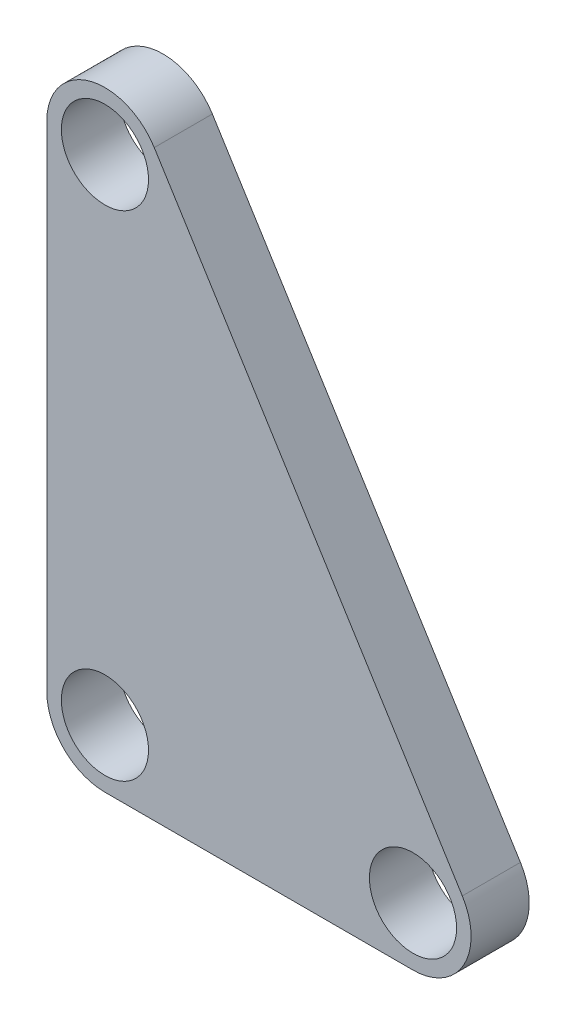
ISO-10303-21;
HEADER;
FILE_DESCRIPTION(('STEP AP214'),'2;1');
FILE_NAME('part.step','',(''),(''),'','','');
FILE_SCHEMA(('AUTOMOTIVE_DESIGN { 1 0 10303 214 1 1 1 1 }'));
ENDSEC;
DATA;
#1=APPLICATION_CONTEXT('core data for automotive mechanical design processes');
#2=APPLICATION_PROTOCOL_DEFINITION('international standard','automotive_design',2000,#1);
#3=PRODUCT_CONTEXT('',#1,'mechanical');
#4=PRODUCT('Part','Part','',(#3));
#5=PRODUCT_RELATED_PRODUCT_CATEGORY('part','',(#4));
#6=PRODUCT_DEFINITION_FORMATION('','',#4);
#7=PRODUCT_DEFINITION_CONTEXT('part definition',#1,'design');
#8=PRODUCT_DEFINITION('design','',#6,#7);
#9=PRODUCT_DEFINITION_SHAPE('','',#8);
#10=(LENGTH_UNIT() NAMED_UNIT(*) SI_UNIT(.MILLI.,.METRE.));
#11=(NAMED_UNIT(*) PLANE_ANGLE_UNIT() SI_UNIT($,.RADIAN.));
#12=(NAMED_UNIT(*) SI_UNIT($,.STERADIAN.) SOLID_ANGLE_UNIT());
#13=UNCERTAINTY_MEASURE_WITH_UNIT(LENGTH_MEASURE(1.E-05),#10,'distance_accuracy_value','');
#14=(GEOMETRIC_REPRESENTATION_CONTEXT(3) GLOBAL_UNCERTAINTY_ASSIGNED_CONTEXT((#13)) GLOBAL_UNIT_ASSIGNED_CONTEXT((#10,
#11,#12)) REPRESENTATION_CONTEXT('',''));
#15=CARTESIAN_POINT('',(0.,0.,0.));
#16=DIRECTION('',(0.,0.,1.));
#17=DIRECTION('',(1.,0.,0.));
#18=AXIS2_PLACEMENT_3D('',#15,#16,#17);
#19=CARTESIAN_POINT('',(1.,9.5,1.));
#20=DIRECTION('',(0.,0.,1.));
#21=DIRECTION('',(1.,0.,0.));
#22=AXIS2_PLACEMENT_3D('',#19,#20,#21);
#23=PLANE('',#22);
#24=CARTESIAN_POINT('',(1.,9.5,1.));
#25=DIRECTION('',(0.,0.,1.));
#26=DIRECTION('',(1.,0.,0.));
#27=AXIS2_PLACEMENT_3D('',#24,#25,#26);
#28=CIRCLE('',#27,0.750000000000001);
#29=CARTESIAN_POINT('',(1.75,9.5,1.));
#30=VERTEX_POINT('',#29);
#31=EDGE_CURVE('E185',#30,#30,#28,.T.);
#32=ORIENTED_EDGE('',*,*,#31,.F.);
#33=EDGE_LOOP('',(#32));
#34=FACE_BOUND('',#33,.T.);
#35=CARTESIAN_POINT('',(1.,9.5,1.));
#36=DIRECTION('',(0.,0.,1.));
#37=DIRECTION('',(1.,0.,0.));
#38=AXIS2_PLACEMENT_3D('',#35,#36,#37);
#39=CIRCLE('',#38,1.);
#40=CARTESIAN_POINT('',(1.84855867434084,10.0291012910596,1.));
#41=VERTEX_POINT('',#40);
#42=CARTESIAN_POINT('',(0.,9.5,1.));
#43=VERTEX_POINT('',#42);
#44=EDGE_CURVE('E130',#41,#43,#39,.T.);
#45=ORIENTED_EDGE('',*,*,#44,.T.);
#46=DIRECTION('',(0.,-1.,0.));
#47=VECTOR('',#46,1.);
#48=CARTESIAN_POINT('',(0.,9.5,1.));
#49=LINE('',#48,#47);
#50=CARTESIAN_POINT('',(0.,1.,1.));
#51=VERTEX_POINT('',#50);
#52=EDGE_CURVE('E88',#43,#51,#49,.T.);
#53=ORIENTED_EDGE('',*,*,#52,.T.);
#54=CARTESIAN_POINT('',(1.,1.,1.));
#55=DIRECTION('',(0.,0.,1.));
#56=DIRECTION('',(1.,0.,0.));
#57=AXIS2_PLACEMENT_3D('',#54,#55,#56);
#58=CIRCLE('',#57,1.);
#59=CARTESIAN_POINT('',(1.,0.,1.));
#60=VERTEX_POINT('',#59);
#61=EDGE_CURVE('E101',#51,#60,#58,.T.);
#62=ORIENTED_EDGE('',*,*,#61,.T.);
#63=DIRECTION('',(1.,0.,0.));
#64=VECTOR('',#63,1.);
#65=CARTESIAN_POINT('',(1.,0.,1.));
#66=LINE('',#65,#64);
#67=CARTESIAN_POINT('',(6.3,0.,1.));
#68=VERTEX_POINT('',#67);
#69=EDGE_CURVE('E95',#60,#68,#66,.T.);
#70=ORIENTED_EDGE('',*,*,#69,.T.);
#71=CARTESIAN_POINT('',(6.3,1.,1.));
#72=DIRECTION('',(0.,0.,1.));
#73=DIRECTION('',(1.,0.,0.));
#74=AXIS2_PLACEMENT_3D('',#71,#72,#73);
#75=CIRCLE('',#74,1.);
#76=CARTESIAN_POINT('',(7.14855867434084,1.52910129105958,1.));
#77=VERTEX_POINT('',#76);
#78=EDGE_CURVE('E99',#68,#77,#75,.T.);
#79=ORIENTED_EDGE('',*,*,#78,.T.);
#80=DIRECTION('',(-0.529101291059582,0.84855867434084,0.));
#81=VECTOR('',#80,1.);
#82=CARTESIAN_POINT('',(7.14855867434084,1.52910129105958,1.));
#83=LINE('',#82,#81);
#84=EDGE_CURVE('E51',#77,#41,#83,.T.);
#85=ORIENTED_EDGE('',*,*,#84,.T.);
#86=EDGE_LOOP('',(#45,#53,#62,#70,#79,#85));
#87=FACE_BOUND('',#86,.T.);
#88=CARTESIAN_POINT('',(1.,1.,1.));
#89=DIRECTION('',(0.,0.,1.));
#90=DIRECTION('',(1.,0.,0.));
#91=AXIS2_PLACEMENT_3D('',#88,#89,#90);
#92=CIRCLE('',#91,0.750000000000001);
#93=CARTESIAN_POINT('',(1.75,1.,1.));
#94=VERTEX_POINT('',#93);
#95=EDGE_CURVE('E123',#94,#94,#92,.T.);
#96=ORIENTED_EDGE('',*,*,#95,.F.);
#97=EDGE_LOOP('',(#96));
#98=FACE_BOUND('',#97,.T.);
#99=CARTESIAN_POINT('',(6.3,1.,1.));
#100=DIRECTION('',(0.,0.,1.));
#101=DIRECTION('',(1.,0.,0.));
#102=AXIS2_PLACEMENT_3D('',#99,#100,#101);
#103=CIRCLE('',#102,0.750000000000002);
#104=CARTESIAN_POINT('',(7.05,1.,1.));
#105=VERTEX_POINT('',#104);
#106=EDGE_CURVE('E176',#105,#105,#103,.T.);
#107=ORIENTED_EDGE('',*,*,#106,.F.);
#108=EDGE_LOOP('',(#107));
#109=FACE_BOUND('',#108,.T.);
#110=ADVANCED_FACE('F34',(#34,#87,#98,#109),#23,.T.);
#111=CARTESIAN_POINT('',(1.,9.5,0.));
#112=DIRECTION('',(0.,0.,1.));
#113=DIRECTION('',(1.,0.,0.));
#114=AXIS2_PLACEMENT_3D('',#111,#112,#113);
#115=PLANE('',#114);
#116=CARTESIAN_POINT('',(1.,9.5,0.));
#117=DIRECTION('',(0.,0.,1.));
#118=DIRECTION('',(1.,0.,0.));
#119=AXIS2_PLACEMENT_3D('',#116,#117,#118);
#120=CIRCLE('',#119,1.);
#121=CARTESIAN_POINT('',(1.84855867434084,10.0291012910596,0.));
#122=VERTEX_POINT('',#121);
#123=CARTESIAN_POINT('',(0.,9.5,0.));
#124=VERTEX_POINT('',#123);
#125=EDGE_CURVE('E119',#122,#124,#120,.T.);
#126=ORIENTED_EDGE('',*,*,#125,.F.);
#127=DIRECTION('',(-0.529101291059582,0.84855867434084,0.));
#128=VECTOR('',#127,1.);
#129=CARTESIAN_POINT('',(7.14855867434084,1.52910129105958,0.));
#130=LINE('',#129,#128);
#131=CARTESIAN_POINT('',(7.14855867434084,1.52910129105958,0.));
#132=VERTEX_POINT('',#131);
#133=EDGE_CURVE('E80',#132,#122,#130,.T.);
#134=ORIENTED_EDGE('',*,*,#133,.F.);
#135=CARTESIAN_POINT('',(6.3,1.,0.));
#136=DIRECTION('',(0.,0.,1.));
#137=DIRECTION('',(1.,0.,0.));
#138=AXIS2_PLACEMENT_3D('',#135,#136,#137);
#139=CIRCLE('',#138,1.);
#140=CARTESIAN_POINT('',(6.3,0.,0.));
#141=VERTEX_POINT('',#140);
#142=EDGE_CURVE('E74',#141,#132,#139,.T.);
#143=ORIENTED_EDGE('',*,*,#142,.F.);
#144=DIRECTION('',(1.,0.,0.));
#145=VECTOR('',#144,1.);
#146=CARTESIAN_POINT('',(1.,0.,0.));
#147=LINE('',#146,#145);
#148=CARTESIAN_POINT('',(1.,0.,0.));
#149=VERTEX_POINT('',#148);
#150=EDGE_CURVE('E109',#149,#141,#147,.T.);
#151=ORIENTED_EDGE('',*,*,#150,.F.);
#152=CARTESIAN_POINT('',(1.,1.,0.));
#153=DIRECTION('',(0.,0.,1.));
#154=DIRECTION('',(1.,0.,0.));
#155=AXIS2_PLACEMENT_3D('',#152,#153,#154);
#156=CIRCLE('',#155,1.);
#157=CARTESIAN_POINT('',(0.,1.,0.));
#158=VERTEX_POINT('',#157);
#159=EDGE_CURVE('E125',#158,#149,#156,.T.);
#160=ORIENTED_EDGE('',*,*,#159,.F.);
#161=DIRECTION('',(0.,-1.,0.));
#162=VECTOR('',#161,1.);
#163=CARTESIAN_POINT('',(0.,9.5,0.));
#164=LINE('',#163,#162);
#165=EDGE_CURVE('E122',#124,#158,#164,.T.);
#166=ORIENTED_EDGE('',*,*,#165,.F.);
#167=EDGE_LOOP('',(#126,#134,#143,#151,#160,#166));
#168=FACE_BOUND('',#167,.T.);
#169=CARTESIAN_POINT('',(1.,1.,0.));
#170=DIRECTION('',(0.,0.,1.));
#171=DIRECTION('',(1.,0.,0.));
#172=AXIS2_PLACEMENT_3D('',#169,#170,#171);
#173=CIRCLE('',#172,0.750000000000001);
#174=CARTESIAN_POINT('',(1.75,1.,0.));
#175=VERTEX_POINT('',#174);
#176=EDGE_CURVE('E188',#175,#175,#173,.T.);
#177=ORIENTED_EDGE('',*,*,#176,.T.);
#178=EDGE_LOOP('',(#177));
#179=FACE_BOUND('',#178,.T.);
#180=CARTESIAN_POINT('',(1.,9.5,0.));
#181=DIRECTION('',(0.,0.,1.));
#182=DIRECTION('',(1.,0.,0.));
#183=AXIS2_PLACEMENT_3D('',#180,#181,#182);
#184=CIRCLE('',#183,0.750000000000001);
#185=CARTESIAN_POINT('',(1.75,9.5,0.));
#186=VERTEX_POINT('',#185);
#187=EDGE_CURVE('E182',#186,#186,#184,.T.);
#188=ORIENTED_EDGE('',*,*,#187,.T.);
#189=EDGE_LOOP('',(#188));
#190=FACE_BOUND('',#189,.T.);
#191=CARTESIAN_POINT('',(6.3,1.,0.));
#192=DIRECTION('',(0.,0.,1.));
#193=DIRECTION('',(1.,0.,0.));
#194=AXIS2_PLACEMENT_3D('',#191,#192,#193);
#195=CIRCLE('',#194,0.750000000000002);
#196=CARTESIAN_POINT('',(7.05,1.,0.));
#197=VERTEX_POINT('',#196);
#198=EDGE_CURVE('E179',#197,#197,#195,.T.);
#199=ORIENTED_EDGE('',*,*,#198,.T.);
#200=EDGE_LOOP('',(#199));
#201=FACE_BOUND('',#200,.T.);
#202=ADVANCED_FACE('F139',(#168,#179,#190,#201),#115,.F.);
#203=CARTESIAN_POINT('',(1.,9.5,1.));
#204=DIRECTION('',(0.,0.,-1.));
#205=DIRECTION('',(-1.,0.,0.));
#206=AXIS2_PLACEMENT_3D('',#203,#204,#205);
#207=CYLINDRICAL_SURFACE('',#206,1.);
#208=ORIENTED_EDGE('',*,*,#125,.T.);
#209=DIRECTION('',(0.,0.,-1.));
#210=VECTOR('',#209,1.);
#211=CARTESIAN_POINT('',(0.,9.5,1.));
#212=LINE('',#211,#210);
#213=EDGE_CURVE('E11',#43,#124,#212,.T.);
#214=ORIENTED_EDGE('',*,*,#213,.F.);
#215=ORIENTED_EDGE('',*,*,#44,.F.);
#216=DIRECTION('',(0.,0.,-1.));
#217=VECTOR('',#216,1.);
#218=CARTESIAN_POINT('',(1.84855867434084,10.0291012910596,1.));
#219=LINE('',#218,#217);
#220=EDGE_CURVE('E115',#41,#122,#219,.T.);
#221=ORIENTED_EDGE('',*,*,#220,.T.);
#222=EDGE_LOOP('',(#208,#214,#215,#221));
#223=FACE_BOUND('',#222,.T.);
#224=ADVANCED_FACE('F36',(#223),#207,.T.);
#225=CARTESIAN_POINT('',(0.,9.5,1.));
#226=DIRECTION('',(1.,0.,0.));
#227=DIRECTION('',(0.,1.,0.));
#228=AXIS2_PLACEMENT_3D('',#225,#226,#227);
#229=PLANE('',#228);
#230=ORIENTED_EDGE('',*,*,#165,.T.);
#231=DIRECTION('',(0.,0.,-1.));
#232=VECTOR('',#231,1.);
#233=CARTESIAN_POINT('',(0.,1.,1.));
#234=LINE('',#233,#232);
#235=EDGE_CURVE('E43',#51,#158,#234,.T.);
#236=ORIENTED_EDGE('',*,*,#235,.F.);
#237=ORIENTED_EDGE('',*,*,#52,.F.);
#238=ORIENTED_EDGE('',*,*,#213,.T.);
#239=EDGE_LOOP('',(#230,#236,#237,#238));
#240=FACE_BOUND('',#239,.T.);
#241=ADVANCED_FACE('F238',(#240),#229,.F.);
#242=CARTESIAN_POINT('',(1.,1.,1.));
#243=DIRECTION('',(0.,0.,-1.));
#244=DIRECTION('',(-1.,0.,0.));
#245=AXIS2_PLACEMENT_3D('',#242,#243,#244);
#246=CYLINDRICAL_SURFACE('',#245,1.);
#247=ORIENTED_EDGE('',*,*,#159,.T.);
#248=DIRECTION('',(0.,0.,-1.));
#249=VECTOR('',#248,1.);
#250=CARTESIAN_POINT('',(1.,0.,1.));
#251=LINE('',#250,#249);
#252=EDGE_CURVE('E110',#60,#149,#251,.T.);
#253=ORIENTED_EDGE('',*,*,#252,.F.);
#254=ORIENTED_EDGE('',*,*,#61,.F.);
#255=ORIENTED_EDGE('',*,*,#235,.T.);
#256=EDGE_LOOP('',(#247,#253,#254,#255));
#257=FACE_BOUND('',#256,.T.);
#258=ADVANCED_FACE('F136',(#257),#246,.T.);
#259=CARTESIAN_POINT('',(1.,0.,1.));
#260=DIRECTION('',(0.,1.,0.));
#261=DIRECTION('',(0.,0.,1.));
#262=AXIS2_PLACEMENT_3D('',#259,#260,#261);
#263=PLANE('',#262);
#264=ORIENTED_EDGE('',*,*,#150,.T.);
#265=DIRECTION('',(0.,0.,-1.));
#266=VECTOR('',#265,1.);
#267=CARTESIAN_POINT('',(6.3,0.,1.));
#268=LINE('',#267,#266);
#269=EDGE_CURVE('E106',#68,#141,#268,.T.);
#270=ORIENTED_EDGE('',*,*,#269,.F.);
#271=ORIENTED_EDGE('',*,*,#69,.F.);
#272=ORIENTED_EDGE('',*,*,#252,.T.);
#273=EDGE_LOOP('',(#264,#270,#271,#272));
#274=FACE_BOUND('',#273,.T.);
#275=ADVANCED_FACE('F107',(#274),#263,.F.);
#276=CARTESIAN_POINT('',(6.3,1.,1.));
#277=DIRECTION('',(0.,0.,-1.));
#278=DIRECTION('',(-1.,0.,0.));
#279=AXIS2_PLACEMENT_3D('',#276,#277,#278);
#280=CYLINDRICAL_SURFACE('',#279,1.);
#281=ORIENTED_EDGE('',*,*,#142,.T.);
#282=DIRECTION('',(0.,0.,-1.));
#283=VECTOR('',#282,1.);
#284=CARTESIAN_POINT('',(7.14855867434084,1.52910129105958,1.));
#285=LINE('',#284,#283);
#286=EDGE_CURVE('E111',#77,#132,#285,.T.);
#287=ORIENTED_EDGE('',*,*,#286,.F.);
#288=ORIENTED_EDGE('',*,*,#78,.F.);
#289=ORIENTED_EDGE('',*,*,#269,.T.);
#290=EDGE_LOOP('',(#281,#287,#288,#289));
#291=FACE_BOUND('',#290,.T.);
#292=ADVANCED_FACE('F113',(#291),#280,.T.);
#293=CARTESIAN_POINT('',(7.14855867434084,1.52910129105958,1.));
#294=DIRECTION('',(-0.84855867434084,-0.529101291059582,0.));
#295=DIRECTION('',(0.529101291059582,-0.84855867434084,0.));
#296=AXIS2_PLACEMENT_3D('',#293,#294,#295);
#297=PLANE('',#296);
#298=ORIENTED_EDGE('',*,*,#133,.T.);
#299=ORIENTED_EDGE('',*,*,#220,.F.);
#300=ORIENTED_EDGE('',*,*,#84,.F.);
#301=ORIENTED_EDGE('',*,*,#286,.T.);
#302=EDGE_LOOP('',(#298,#299,#300,#301));
#303=FACE_BOUND('',#302,.T.);
#304=ADVANCED_FACE('F144',(#303),#297,.F.);
#305=CARTESIAN_POINT('',(1.,1.,1.));
#306=DIRECTION('',(0.,0.,-1.));
#307=DIRECTION('',(-1.,0.,0.));
#308=AXIS2_PLACEMENT_3D('',#305,#306,#307);
#309=CYLINDRICAL_SURFACE('',#308,0.750000000000001);
#310=ORIENTED_EDGE('',*,*,#95,.T.);
#311=EDGE_LOOP('',(#310));
#312=FACE_BOUND('',#311,.T.);
#313=ORIENTED_EDGE('',*,*,#176,.F.);
#314=EDGE_LOOP('',(#313));
#315=FACE_BOUND('',#314,.T.);
#316=ADVANCED_FACE('F146',(#312,#315),#309,.F.);
#317=CARTESIAN_POINT('',(1.,9.5,1.));
#318=DIRECTION('',(0.,0.,-1.));
#319=DIRECTION('',(-1.,0.,0.));
#320=AXIS2_PLACEMENT_3D('',#317,#318,#319);
#321=CYLINDRICAL_SURFACE('',#320,0.750000000000001);
#322=ORIENTED_EDGE('',*,*,#31,.T.);
#323=EDGE_LOOP('',(#322));
#324=FACE_BOUND('',#323,.T.);
#325=ORIENTED_EDGE('',*,*,#187,.F.);
#326=EDGE_LOOP('',(#325));
#327=FACE_BOUND('',#326,.T.);
#328=ADVANCED_FACE('F152',(#324,#327),#321,.F.);
#329=CARTESIAN_POINT('',(6.3,1.,1.));
#330=DIRECTION('',(0.,0.,-1.));
#331=DIRECTION('',(-1.,0.,0.));
#332=AXIS2_PLACEMENT_3D('',#329,#330,#331);
#333=CYLINDRICAL_SURFACE('',#332,0.750000000000002);
#334=ORIENTED_EDGE('',*,*,#106,.T.);
#335=EDGE_LOOP('',(#334));
#336=FACE_BOUND('',#335,.T.);
#337=ORIENTED_EDGE('',*,*,#198,.F.);
#338=EDGE_LOOP('',(#337));
#339=FACE_BOUND('',#338,.T.);
#340=ADVANCED_FACE('F167',(#336,#339),#333,.F.);
#341=CLOSED_SHELL('',(#110,#202,#224,#241,#258,#275,#292,#304,#316,#328,#340));
#342=MANIFOLD_SOLID_BREP('B2',#341);
#343=ADVANCED_BREP_SHAPE_REPRESENTATION('',(#18,#342),#14);
#344=SHAPE_DEFINITION_REPRESENTATION(#9,#343);
ENDSEC;
END-ISO-10303-21;
